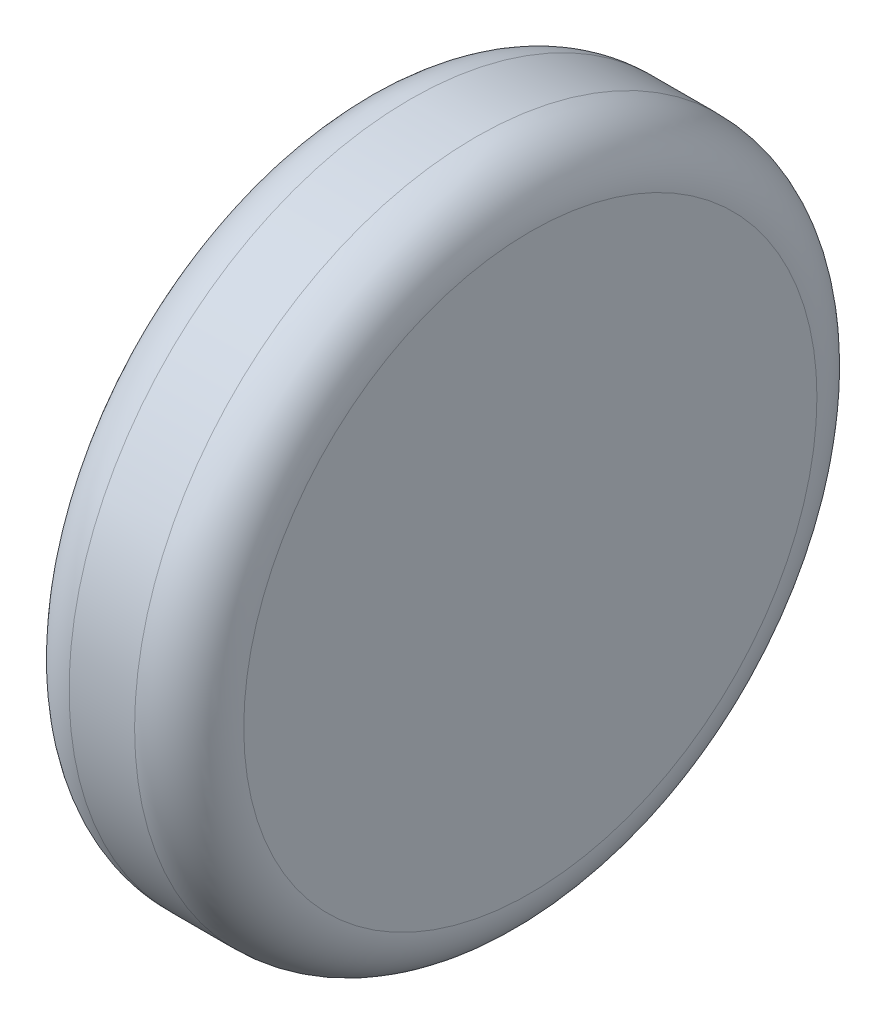
ISO-10303-21;
HEADER;
FILE_DESCRIPTION(('STEP AP214'),'2;1');
FILE_NAME('part.step','',(''),(''),'','','');
FILE_SCHEMA(('AUTOMOTIVE_DESIGN { 1 0 10303 214 1 1 1 1 }'));
ENDSEC;
DATA;
#1=APPLICATION_CONTEXT('core data for automotive mechanical design processes');
#2=APPLICATION_PROTOCOL_DEFINITION('international standard','automotive_design',2000,#1);
#3=PRODUCT_CONTEXT('',#1,'mechanical');
#4=PRODUCT('Part','Part','',(#3));
#5=PRODUCT_RELATED_PRODUCT_CATEGORY('part','',(#4));
#6=PRODUCT_DEFINITION_FORMATION('','',#4);
#7=PRODUCT_DEFINITION_CONTEXT('part definition',#1,'design');
#8=PRODUCT_DEFINITION('design','',#6,#7);
#9=PRODUCT_DEFINITION_SHAPE('','',#8);
#10=(LENGTH_UNIT() NAMED_UNIT(*) SI_UNIT(.MILLI.,.METRE.));
#11=(NAMED_UNIT(*) PLANE_ANGLE_UNIT() SI_UNIT($,.RADIAN.));
#12=(NAMED_UNIT(*) SI_UNIT($,.STERADIAN.) SOLID_ANGLE_UNIT());
#13=UNCERTAINTY_MEASURE_WITH_UNIT(LENGTH_MEASURE(1.E-05),#10,'distance_accuracy_value','');
#14=(GEOMETRIC_REPRESENTATION_CONTEXT(3) GLOBAL_UNCERTAINTY_ASSIGNED_CONTEXT((#13)) GLOBAL_UNIT_ASSIGNED_CONTEXT((#10,
#11,#12)) REPRESENTATION_CONTEXT('',''));
#15=CARTESIAN_POINT('',(0.,0.,0.));
#16=DIRECTION('',(0.,0.,1.));
#17=DIRECTION('',(1.,0.,0.));
#18=AXIS2_PLACEMENT_3D('',#15,#16,#17);
#19=CARTESIAN_POINT('',(-0.270364285309383,-0.332340218761648,0.1012));
#20=DIRECTION('',(1.,0.,0.));
#21=DIRECTION('',(0.,1.,0.));
#22=AXIS2_PLACEMENT_3D('',#19,#20,#21);
#23=PLANE('',#22);
#24=CARTESIAN_POINT('',(-0.270364285309383,-0.332340218761648,0.1012));
#25=DIRECTION('',(1.,0.,0.));
#26=DIRECTION('',(0.,0.,-1.));
#27=AXIS2_PLACEMENT_3D('',#24,#25,#26);
#28=CIRCLE('',#27,0.0262499999999999);
#29=CARTESIAN_POINT('',(-0.270364285309383,-0.332340218761648,0.0749500000000001));
#30=VERTEX_POINT('',#29);
#31=CARTESIAN_POINT('',(-0.270364285309383,-0.306090218761648,0.1012));
#32=VERTEX_POINT('',#31);
#33=EDGE_CURVE('E55',#30,#32,#28,.T.);
#34=ORIENTED_EDGE('',*,*,#33,.F.);
#35=CARTESIAN_POINT('',(-0.270364285309383,-0.332340218761648,0.1012));
#36=DIRECTION('',(1.,0.,0.));
#37=DIRECTION('',(0.,0.,1.));
#38=AXIS2_PLACEMENT_3D('',#35,#36,#37);
#39=CIRCLE('',#38,0.02625);
#40=CARTESIAN_POINT('',(-0.270364285309383,-0.332340218761648,0.12745));
#41=VERTEX_POINT('',#40);
#42=EDGE_CURVE('E49',#41,#30,#39,.T.);
#43=ORIENTED_EDGE('',*,*,#42,.F.);
#44=CARTESIAN_POINT('',(-0.270364285309383,-0.332340218761648,0.1012));
#45=DIRECTION('',(1.,0.,0.));
#46=DIRECTION('',(0.,1.,0.));
#47=AXIS2_PLACEMENT_3D('',#44,#45,#46);
#48=CIRCLE('',#47,0.02625);
#49=EDGE_CURVE('E53',#32,#41,#48,.T.);
#50=ORIENTED_EDGE('',*,*,#49,.F.);
#51=EDGE_LOOP('',(#34,#43,#50));
#52=FACE_BOUND('',#51,.T.);
#53=ADVANCED_FACE('F17',(#52),#23,.F.);
#54=CARTESIAN_POINT('',(-0.265364285309383,-0.332340218761648,0.1012));
#55=DIRECTION('',(1.,0.,0.));
#56=DIRECTION('',(0.,0.,1.));
#57=AXIS2_PLACEMENT_3D('',#54,#55,#56);
#58=TOROIDAL_SURFACE('',#57,0.02625,0.005);
#59=CARTESIAN_POINT('',(-0.265364285309383,-0.332340218761648,0.1012));
#60=DIRECTION('',(1.,0.,0.));
#61=DIRECTION('',(0.,1.,0.));
#62=AXIS2_PLACEMENT_3D('',#59,#60,#61);
#63=CIRCLE('',#62,0.03125);
#64=CARTESIAN_POINT('',(-0.265364285309383,-0.301090218761648,0.1012));
#65=VERTEX_POINT('',#64);
#66=EDGE_CURVE('E62',#65,#65,#63,.T.);
#67=ORIENTED_EDGE('',*,*,#66,.F.);
#68=EDGE_LOOP('',(#67));
#69=FACE_BOUND('',#68,.T.);
#70=ORIENTED_EDGE('',*,*,#33,.T.);
#71=ORIENTED_EDGE('',*,*,#49,.T.);
#72=ORIENTED_EDGE('',*,*,#42,.T.);
#73=EDGE_LOOP('',(#70,#71,#72));
#74=FACE_BOUND('',#73,.T.);
#75=ADVANCED_FACE('F60',(#69,#74),#58,.T.);
#76=CARTESIAN_POINT('',(-0.254364285309383,-0.332340218761648,0.1012));
#77=DIRECTION('',(1.,0.,0.));
#78=DIRECTION('',(0.,1.,0.));
#79=AXIS2_PLACEMENT_3D('',#76,#77,#78);
#80=CYLINDRICAL_SURFACE('',#79,0.03125);
#81=CARTESIAN_POINT('',(-0.259364285309383,-0.332340218761648,0.1012));
#82=DIRECTION('',(1.,0.,0.));
#83=DIRECTION('',(0.,0.,1.));
#84=AXIS2_PLACEMENT_3D('',#81,#82,#83);
#85=CIRCLE('',#84,0.03125);
#86=CARTESIAN_POINT('',(-0.259364285309383,-0.332340218761648,0.13245));
#87=VERTEX_POINT('',#86);
#88=EDGE_CURVE('E86',#87,#87,#85,.T.);
#89=ORIENTED_EDGE('',*,*,#88,.F.);
#90=EDGE_LOOP('',(#89));
#91=FACE_BOUND('',#90,.T.);
#92=ORIENTED_EDGE('',*,*,#66,.T.);
#93=EDGE_LOOP('',(#92));
#94=FACE_BOUND('',#93,.T.);
#95=ADVANCED_FACE('F79',(#91,#94),#80,.T.);
#96=CARTESIAN_POINT('',(-0.259364285309383,-0.332340218761648,0.1012));
#97=DIRECTION('',(1.,0.,0.));
#98=DIRECTION('',(0.,0.,1.));
#99=AXIS2_PLACEMENT_3D('',#96,#97,#98);
#100=TOROIDAL_SURFACE('',#99,0.02625,0.005);
#101=ORIENTED_EDGE('',*,*,#88,.T.);
#102=EDGE_LOOP('',(#101));
#103=FACE_BOUND('',#102,.T.);
#104=CARTESIAN_POINT('',(-0.254364285309383,-0.332340218761648,0.1012));
#105=DIRECTION('',(-1.,0.,0.));
#106=DIRECTION('',(0.,0.,-1.));
#107=AXIS2_PLACEMENT_3D('',#104,#105,#106);
#108=CIRCLE('',#107,0.0262499999999999);
#109=CARTESIAN_POINT('',(-0.254364285309383,-0.332340218761648,0.12745));
#110=VERTEX_POINT('',#109);
#111=CARTESIAN_POINT('',(-0.254364285309383,-0.332340218761648,0.0749500000000001));
#112=VERTEX_POINT('',#111);
#113=EDGE_CURVE('E11',#110,#112,#108,.F.);
#114=ORIENTED_EDGE('',*,*,#113,.F.);
#115=CARTESIAN_POINT('',(-0.254364285309383,-0.332340218761648,0.1012));
#116=DIRECTION('',(-1.,0.,0.));
#117=DIRECTION('',(0.,0.,1.));
#118=AXIS2_PLACEMENT_3D('',#115,#116,#117);
#119=CIRCLE('',#118,0.02625);
#120=CARTESIAN_POINT('',(-0.254364285309383,-0.306090218761648,0.1012));
#121=VERTEX_POINT('',#120);
#122=EDGE_CURVE('E28',#121,#110,#119,.F.);
#123=ORIENTED_EDGE('',*,*,#122,.F.);
#124=CARTESIAN_POINT('',(-0.254364285309383,-0.332340218761648,0.1012));
#125=DIRECTION('',(-1.,0.,0.));
#126=DIRECTION('',(0.,1.,0.));
#127=AXIS2_PLACEMENT_3D('',#124,#125,#126);
#128=CIRCLE('',#127,0.02625);
#129=EDGE_CURVE('E92',#112,#121,#128,.F.);
#130=ORIENTED_EDGE('',*,*,#129,.F.);
#131=EDGE_LOOP('',(#114,#123,#130));
#132=FACE_BOUND('',#131,.T.);
#133=ADVANCED_FACE('F117',(#103,#132),#100,.T.);
#134=CARTESIAN_POINT('',(-0.254364285309383,-0.332340218761648,0.1012));
#135=DIRECTION('',(1.,0.,0.));
#136=DIRECTION('',(0.,1.,0.));
#137=AXIS2_PLACEMENT_3D('',#134,#135,#136);
#138=PLANE('',#137);
#139=ORIENTED_EDGE('',*,*,#122,.T.);
#140=ORIENTED_EDGE('',*,*,#113,.T.);
#141=ORIENTED_EDGE('',*,*,#129,.T.);
#142=EDGE_LOOP('',(#139,#140,#141));
#143=FACE_BOUND('',#142,.T.);
#144=ADVANCED_FACE('F99',(#143),#138,.T.);
#145=CLOSED_SHELL('',(#53,#75,#95,#133,#144));
#146=MANIFOLD_SOLID_BREP('B1',#145);
#147=ADVANCED_BREP_SHAPE_REPRESENTATION('',(#18,#146),#14);
#148=SHAPE_DEFINITION_REPRESENTATION(#9,#147);
ENDSEC;
END-ISO-10303-21;
